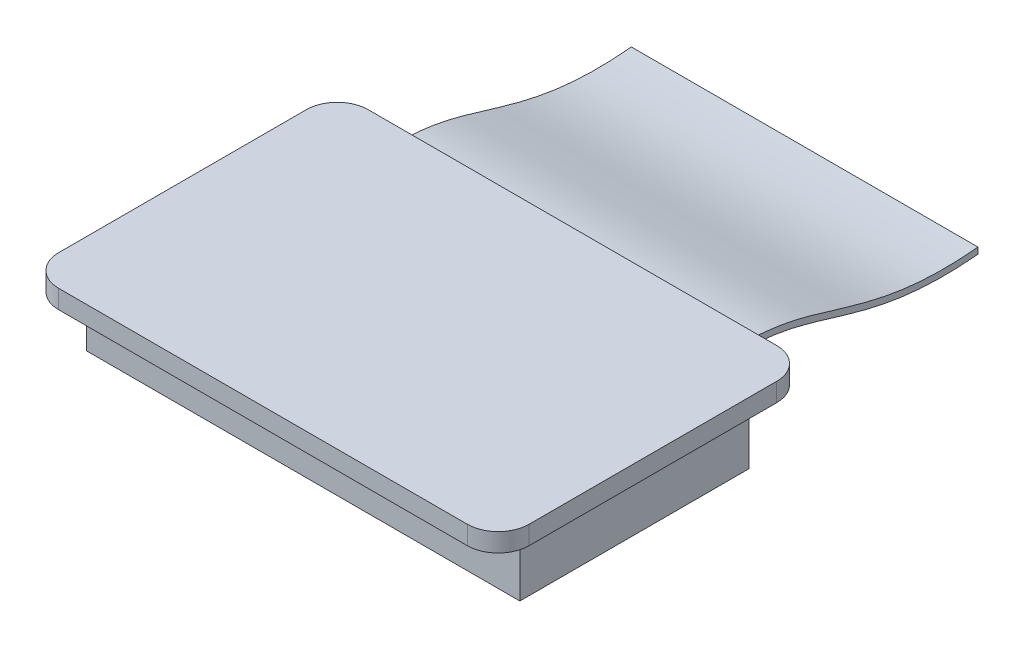
ISO-10303-21;
HEADER;
FILE_DESCRIPTION(('STEP AP214'),'2;1');
FILE_NAME('part.step','',(''),(''),'','','');
FILE_SCHEMA(('AUTOMOTIVE_DESIGN { 1 0 10303 214 1 1 1 1 }'));
ENDSEC;
DATA;
#1=APPLICATION_CONTEXT('core data for automotive mechanical design processes');
#2=APPLICATION_PROTOCOL_DEFINITION('international standard','automotive_design',2000,#1);
#3=PRODUCT_CONTEXT('',#1,'mechanical');
#4=PRODUCT('Part','Part','',(#3));
#5=PRODUCT_RELATED_PRODUCT_CATEGORY('part','',(#4));
#6=PRODUCT_DEFINITION_FORMATION('','',#4);
#7=PRODUCT_DEFINITION_CONTEXT('part definition',#1,'design');
#8=PRODUCT_DEFINITION('design','',#6,#7);
#9=PRODUCT_DEFINITION_SHAPE('','',#8);
#10=(LENGTH_UNIT() NAMED_UNIT(*) SI_UNIT(.MILLI.,.METRE.));
#11=(NAMED_UNIT(*) PLANE_ANGLE_UNIT() SI_UNIT($,.RADIAN.));
#12=(NAMED_UNIT(*) SI_UNIT($,.STERADIAN.) SOLID_ANGLE_UNIT());
#13=UNCERTAINTY_MEASURE_WITH_UNIT(LENGTH_MEASURE(1.E-05),#10,'distance_accuracy_value','');
#14=(GEOMETRIC_REPRESENTATION_CONTEXT(3) GLOBAL_UNCERTAINTY_ASSIGNED_CONTEXT((#13)) GLOBAL_UNIT_ASSIGNED_CONTEXT((#10,
#11,#12)) REPRESENTATION_CONTEXT('',''));
#15=CARTESIAN_POINT('',(0.,0.,0.));
#16=DIRECTION('',(0.,0.,1.));
#17=DIRECTION('',(1.,0.,0.));
#18=AXIS2_PLACEMENT_3D('',#15,#16,#17);
#19=CARTESIAN_POINT('',(3.3,0.748301222298696,8.25169585037883));
#20=DIRECTION('',(0.,-1.,0.));
#21=DIRECTION('',(0.,0.,-1.));
#22=AXIS2_PLACEMENT_3D('',#19,#20,#21);
#23=CYLINDRICAL_SURFACE('',#22,0.5);
#24=CARTESIAN_POINT('',(3.3,0.448301222298696,8.25169585037883));
#25=DIRECTION('',(0.,-1.,0.));
#26=DIRECTION('',(0.,0.,-1.));
#27=AXIS2_PLACEMENT_3D('',#24,#25,#26);
#28=CIRCLE('',#27,0.5);
#29=CARTESIAN_POINT('',(3.3,0.448301222298696,7.75169585037883));
#30=VERTEX_POINT('',#29);
#31=CARTESIAN_POINT('',(3.8,0.448301222298696,8.25169585037883));
#32=VERTEX_POINT('',#31);
#33=EDGE_CURVE('E172',#30,#32,#28,.T.);
#34=ORIENTED_EDGE('',*,*,#33,.F.);
#35=DIRECTION('',(0.,-1.,0.));
#36=VECTOR('',#35,1.);
#37=CARTESIAN_POINT('',(3.3,0.748301222298696,7.75169585037883));
#38=LINE('',#37,#36);
#39=CARTESIAN_POINT('',(3.3,0.748301222298696,7.75169585037883));
#40=VERTEX_POINT('',#39);
#41=EDGE_CURVE('E13',#40,#30,#38,.T.);
#42=ORIENTED_EDGE('',*,*,#41,.F.);
#43=CARTESIAN_POINT('',(3.3,0.748301222298696,8.25169585037883));
#44=DIRECTION('',(0.,-1.,0.));
#45=DIRECTION('',(0.,0.,-1.));
#46=AXIS2_PLACEMENT_3D('',#43,#44,#45);
#47=CIRCLE('',#46,0.5);
#48=CARTESIAN_POINT('',(3.8,0.748301222298696,8.25169585037883));
#49=VERTEX_POINT('',#48);
#50=EDGE_CURVE('E193',#40,#49,#47,.T.);
#51=ORIENTED_EDGE('',*,*,#50,.T.);
#52=DIRECTION('',(0.,-1.,0.));
#53=VECTOR('',#52,1.);
#54=CARTESIAN_POINT('',(3.8,0.748301222298696,8.25169585037883));
#55=LINE('',#54,#53);
#56=EDGE_CURVE('E65',#49,#32,#55,.T.);
#57=ORIENTED_EDGE('',*,*,#56,.T.);
#58=EDGE_LOOP('',(#34,#42,#51,#57));
#59=FACE_BOUND('',#58,.T.);
#60=ADVANCED_FACE('F62',(#59),#23,.T.);
#61=CARTESIAN_POINT('',(-3.3,0.748301222298696,7.75169585037883));
#62=DIRECTION('',(0.,0.,-1.));
#63=DIRECTION('',(-1.,0.,0.));
#64=AXIS2_PLACEMENT_3D('',#61,#62,#63);
#65=PLANE('',#64);
#66=DIRECTION('',(1.,0.,0.));
#67=VECTOR('',#66,1.);
#68=CARTESIAN_POINT('',(-3.3,0.448301222298696,7.75169585037883));
#69=LINE('',#68,#67);
#70=CARTESIAN_POINT('',(-3.3,0.448301222298696,7.75169585037883));
#71=VERTEX_POINT('',#70);
#72=EDGE_CURVE('E191',#71,#30,#69,.T.);
#73=ORIENTED_EDGE('',*,*,#72,.F.);
#74=DIRECTION('',(0.,-1.,0.));
#75=VECTOR('',#74,1.);
#76=CARTESIAN_POINT('',(-3.3,0.748301222298696,7.75169585037883));
#77=LINE('',#76,#75);
#78=CARTESIAN_POINT('',(-3.3,0.748301222298696,7.75169585037883));
#79=VERTEX_POINT('',#78);
#80=EDGE_CURVE('E70',#79,#71,#77,.T.);
#81=ORIENTED_EDGE('',*,*,#80,.F.);
#82=DIRECTION('',(1.,0.,0.));
#83=VECTOR('',#82,1.);
#84=CARTESIAN_POINT('',(-3.3,0.748301222298696,7.75169585037883));
#85=LINE('',#84,#83);
#86=EDGE_CURVE('E162',#79,#40,#85,.T.);
#87=ORIENTED_EDGE('',*,*,#86,.T.);
#88=ORIENTED_EDGE('',*,*,#41,.T.);
#89=EDGE_LOOP('',(#73,#81,#87,#88));
#90=FACE_BOUND('',#89,.T.);
#91=ADVANCED_FACE('F205',(#90),#65,.T.);
#92=CARTESIAN_POINT('',(-3.3,0.748301222298696,8.25169585037883));
#93=DIRECTION('',(0.,-1.,0.));
#94=DIRECTION('',(0.,0.,-1.));
#95=AXIS2_PLACEMENT_3D('',#92,#93,#94);
#96=CYLINDRICAL_SURFACE('',#95,0.5);
#97=CARTESIAN_POINT('',(-3.3,0.448301222298696,8.25169585037883));
#98=DIRECTION('',(0.,-1.,0.));
#99=DIRECTION('',(0.,0.,-1.));
#100=AXIS2_PLACEMENT_3D('',#97,#98,#99);
#101=CIRCLE('',#100,0.5);
#102=CARTESIAN_POINT('',(-3.8,0.448301222298696,8.25169585037883));
#103=VERTEX_POINT('',#102);
#104=EDGE_CURVE('E149',#103,#71,#101,.T.);
#105=ORIENTED_EDGE('',*,*,#104,.F.);
#106=DIRECTION('',(0.,-1.,0.));
#107=VECTOR('',#106,1.);
#108=CARTESIAN_POINT('',(-3.8,0.748301222298696,8.25169585037883));
#109=LINE('',#108,#107);
#110=CARTESIAN_POINT('',(-3.8,0.748301222298696,8.25169585037883));
#111=VERTEX_POINT('',#110);
#112=EDGE_CURVE('E143',#111,#103,#109,.T.);
#113=ORIENTED_EDGE('',*,*,#112,.F.);
#114=CARTESIAN_POINT('',(-3.3,0.748301222298696,8.25169585037883));
#115=DIRECTION('',(0.,-1.,0.));
#116=DIRECTION('',(0.,0.,-1.));
#117=AXIS2_PLACEMENT_3D('',#114,#115,#116);
#118=CIRCLE('',#117,0.5);
#119=EDGE_CURVE('E146',#111,#79,#118,.T.);
#120=ORIENTED_EDGE('',*,*,#119,.T.);
#121=ORIENTED_EDGE('',*,*,#80,.T.);
#122=EDGE_LOOP('',(#105,#113,#120,#121));
#123=FACE_BOUND('',#122,.T.);
#124=ADVANCED_FACE('F145',(#123),#96,.T.);
#125=CARTESIAN_POINT('',(-3.8,0.748301222298696,12.2516958503788));
#126=DIRECTION('',(-1.,0.,0.));
#127=DIRECTION('',(0.,0.,1.));
#128=AXIS2_PLACEMENT_3D('',#125,#126,#127);
#129=PLANE('',#128);
#130=DIRECTION('',(0.,0.,-1.));
#131=VECTOR('',#130,1.);
#132=CARTESIAN_POINT('',(-3.8,0.448301222298696,12.2516958503788));
#133=LINE('',#132,#131);
#134=CARTESIAN_POINT('',(-3.8,0.448301222298696,12.2516958503788));
#135=VERTEX_POINT('',#134);
#136=EDGE_CURVE('E188',#135,#103,#133,.T.);
#137=ORIENTED_EDGE('',*,*,#136,.F.);
#138=DIRECTION('',(0.,-1.,0.));
#139=VECTOR('',#138,1.);
#140=CARTESIAN_POINT('',(-3.8,0.748301222298696,12.2516958503788));
#141=LINE('',#140,#139);
#142=CARTESIAN_POINT('',(-3.8,0.748301222298696,12.2516958503788));
#143=VERTEX_POINT('',#142);
#144=EDGE_CURVE('E154',#143,#135,#141,.T.);
#145=ORIENTED_EDGE('',*,*,#144,.F.);
#146=DIRECTION('',(0.,0.,-1.));
#147=VECTOR('',#146,1.);
#148=CARTESIAN_POINT('',(-3.8,0.748301222298696,12.2516958503788));
#149=LINE('',#148,#147);
#150=EDGE_CURVE('E160',#143,#111,#149,.T.);
#151=ORIENTED_EDGE('',*,*,#150,.T.);
#152=ORIENTED_EDGE('',*,*,#112,.T.);
#153=EDGE_LOOP('',(#137,#145,#151,#152));
#154=FACE_BOUND('',#153,.T.);
#155=ADVANCED_FACE('F164',(#154),#129,.T.);
#156=CARTESIAN_POINT('',(-3.3,0.748301222298696,12.2516958503788));
#157=DIRECTION('',(0.,-1.,0.));
#158=DIRECTION('',(0.,0.,-1.));
#159=AXIS2_PLACEMENT_3D('',#156,#157,#158);
#160=CYLINDRICAL_SURFACE('',#159,0.5);
#161=CARTESIAN_POINT('',(-3.3,0.448301222298696,12.2516958503788));
#162=DIRECTION('',(0.,-1.,0.));
#163=DIRECTION('',(0.,0.,-1.));
#164=AXIS2_PLACEMENT_3D('',#161,#162,#163);
#165=CIRCLE('',#164,0.5);
#166=CARTESIAN_POINT('',(-3.3,0.448301222298696,12.7516958503788));
#167=VERTEX_POINT('',#166);
#168=EDGE_CURVE('E185',#167,#135,#165,.T.);
#169=ORIENTED_EDGE('',*,*,#168,.F.);
#170=DIRECTION('',(0.,-1.,0.));
#171=VECTOR('',#170,1.);
#172=CARTESIAN_POINT('',(-3.3,0.748301222298696,12.7516958503788));
#173=LINE('',#172,#171);
#174=CARTESIAN_POINT('',(-3.3,0.748301222298696,12.7516958503788));
#175=VERTEX_POINT('',#174);
#176=EDGE_CURVE('E197',#175,#167,#173,.T.);
#177=ORIENTED_EDGE('',*,*,#176,.F.);
#178=CARTESIAN_POINT('',(-3.3,0.748301222298696,12.2516958503788));
#179=DIRECTION('',(0.,-1.,0.));
#180=DIRECTION('',(0.,0.,-1.));
#181=AXIS2_PLACEMENT_3D('',#178,#179,#180);
#182=CIRCLE('',#181,0.5);
#183=EDGE_CURVE('E165',#175,#143,#182,.T.);
#184=ORIENTED_EDGE('',*,*,#183,.T.);
#185=ORIENTED_EDGE('',*,*,#144,.T.);
#186=EDGE_LOOP('',(#169,#177,#184,#185));
#187=FACE_BOUND('',#186,.T.);
#188=ADVANCED_FACE('F218',(#187),#160,.T.);
#189=CARTESIAN_POINT('',(-3.3,0.748301222298696,12.7516958503788));
#190=DIRECTION('',(0.,0.,1.));
#191=DIRECTION('',(1.,0.,0.));
#192=AXIS2_PLACEMENT_3D('',#189,#190,#191);
#193=PLANE('',#192);
#194=DIRECTION('',(-1.,0.,0.));
#195=VECTOR('',#194,1.);
#196=CARTESIAN_POINT('',(-3.3,0.448301222298696,12.7516958503788));
#197=LINE('',#196,#195);
#198=CARTESIAN_POINT('',(3.3,0.448301222298696,12.7516958503788));
#199=VERTEX_POINT('',#198);
#200=EDGE_CURVE('E182',#199,#167,#197,.T.);
#201=ORIENTED_EDGE('',*,*,#200,.F.);
#202=DIRECTION('',(0.,-1.,0.));
#203=VECTOR('',#202,1.);
#204=CARTESIAN_POINT('',(3.3,0.748301222298696,12.7516958503788));
#205=LINE('',#204,#203);
#206=CARTESIAN_POINT('',(3.3,0.748301222298696,12.7516958503788));
#207=VERTEX_POINT('',#206);
#208=EDGE_CURVE('E199',#207,#199,#205,.T.);
#209=ORIENTED_EDGE('',*,*,#208,.F.);
#210=DIRECTION('',(-1.,0.,0.));
#211=VECTOR('',#210,1.);
#212=CARTESIAN_POINT('',(-3.3,0.748301222298696,12.7516958503788));
#213=LINE('',#212,#211);
#214=EDGE_CURVE('E167',#207,#175,#213,.T.);
#215=ORIENTED_EDGE('',*,*,#214,.T.);
#216=ORIENTED_EDGE('',*,*,#176,.T.);
#217=EDGE_LOOP('',(#201,#209,#215,#216));
#218=FACE_BOUND('',#217,.T.);
#219=ADVANCED_FACE('F221',(#218),#193,.T.);
#220=CARTESIAN_POINT('',(3.3,0.748301222298696,12.2516958503788));
#221=DIRECTION('',(0.,-1.,0.));
#222=DIRECTION('',(0.,0.,-1.));
#223=AXIS2_PLACEMENT_3D('',#220,#221,#222);
#224=CYLINDRICAL_SURFACE('',#223,0.5);
#225=CARTESIAN_POINT('',(3.3,0.448301222298696,12.2516958503788));
#226=DIRECTION('',(0.,-1.,0.));
#227=DIRECTION('',(0.,0.,1.));
#228=AXIS2_PLACEMENT_3D('',#225,#226,#227);
#229=CIRCLE('',#228,0.5);
#230=CARTESIAN_POINT('',(3.8,0.448301222298696,12.2516958503788));
#231=VERTEX_POINT('',#230);
#232=EDGE_CURVE('E179',#231,#199,#229,.T.);
#233=ORIENTED_EDGE('',*,*,#232,.F.);
#234=DIRECTION('',(0.,-1.,0.));
#235=VECTOR('',#234,1.);
#236=CARTESIAN_POINT('',(3.8,0.748301222298696,12.2516958503788));
#237=LINE('',#236,#235);
#238=CARTESIAN_POINT('',(3.8,0.748301222298696,12.2516958503788));
#239=VERTEX_POINT('',#238);
#240=EDGE_CURVE('E200',#239,#231,#237,.T.);
#241=ORIENTED_EDGE('',*,*,#240,.F.);
#242=CARTESIAN_POINT('',(3.3,0.748301222298696,12.2516958503788));
#243=DIRECTION('',(0.,-1.,0.));
#244=DIRECTION('',(0.,0.,1.));
#245=AXIS2_PLACEMENT_3D('',#242,#243,#244);
#246=CIRCLE('',#245,0.5);
#247=EDGE_CURVE('E289',#239,#207,#246,.T.);
#248=ORIENTED_EDGE('',*,*,#247,.T.);
#249=ORIENTED_EDGE('',*,*,#208,.T.);
#250=EDGE_LOOP('',(#233,#241,#248,#249));
#251=FACE_BOUND('',#250,.T.);
#252=ADVANCED_FACE('F225',(#251),#224,.T.);
#253=CARTESIAN_POINT('',(3.8,0.748301222298696,12.2516958503788));
#254=DIRECTION('',(1.,0.,0.));
#255=DIRECTION('',(0.,0.,-1.));
#256=AXIS2_PLACEMENT_3D('',#253,#254,#255);
#257=PLANE('',#256);
#258=DIRECTION('',(0.,0.,1.));
#259=VECTOR('',#258,1.);
#260=CARTESIAN_POINT('',(3.8,0.448301222298696,12.2516958503788));
#261=LINE('',#260,#259);
#262=EDGE_CURVE('E175',#32,#231,#261,.T.);
#263=ORIENTED_EDGE('',*,*,#262,.F.);
#264=ORIENTED_EDGE('',*,*,#56,.F.);
#265=DIRECTION('',(0.,0.,1.));
#266=VECTOR('',#265,1.);
#267=CARTESIAN_POINT('',(3.8,0.748301222298696,12.2516958503788));
#268=LINE('',#267,#266);
#269=EDGE_CURVE('E287',#49,#239,#268,.T.);
#270=ORIENTED_EDGE('',*,*,#269,.T.);
#271=ORIENTED_EDGE('',*,*,#240,.T.);
#272=EDGE_LOOP('',(#263,#264,#270,#271));
#273=FACE_BOUND('',#272,.T.);
#274=ADVANCED_FACE('F202',(#273),#257,.T.);
#275=CARTESIAN_POINT('',(3.3,0.748301222298696,8.25169585037883));
#276=DIRECTION('',(0.,-1.,0.));
#277=DIRECTION('',(0.,0.,-1.));
#278=AXIS2_PLACEMENT_3D('',#275,#276,#277);
#279=PLANE('',#278);
#280=ORIENTED_EDGE('',*,*,#50,.F.);
#281=ORIENTED_EDGE('',*,*,#86,.F.);
#282=ORIENTED_EDGE('',*,*,#119,.F.);
#283=ORIENTED_EDGE('',*,*,#150,.F.);
#284=ORIENTED_EDGE('',*,*,#183,.F.);
#285=ORIENTED_EDGE('',*,*,#214,.F.);
#286=ORIENTED_EDGE('',*,*,#247,.F.);
#287=ORIENTED_EDGE('',*,*,#269,.F.);
#288=EDGE_LOOP('',(#280,#281,#282,#283,#284,#285,#286,#287));
#289=FACE_BOUND('',#288,.T.);
#290=ADVANCED_FACE('F158',(#289),#279,.F.);
#291=CARTESIAN_POINT('',(3.3,0.448301222298696,8.25169585037883));
#292=DIRECTION('',(0.,-1.,0.));
#293=DIRECTION('',(0.,0.,-1.));
#294=AXIS2_PLACEMENT_3D('',#291,#292,#293);
#295=PLANE('',#294);
#296=DIRECTION('',(0.,0.,1.));
#297=VECTOR('',#296,1.);
#298=CARTESIAN_POINT('',(3.5,0.448301222298696,12.1016958503788));
#299=LINE('',#298,#297);
#300=CARTESIAN_POINT('',(3.5,0.448301222298696,8.40169585037883));
#301=VERTEX_POINT('',#300);
#302=CARTESIAN_POINT('',(3.5,0.448301222298696,12.1016958503788));
#303=VERTEX_POINT('',#302);
#304=EDGE_CURVE('E271',#301,#303,#299,.T.);
#305=ORIENTED_EDGE('',*,*,#304,.F.);
#306=DIRECTION('',(-1.,0.,0.));
#307=VECTOR('',#306,1.);
#308=CARTESIAN_POINT('',(3.5,0.448301222298696,8.40169585037883));
#309=LINE('',#308,#307);
#310=CARTESIAN_POINT('',(-3.5,0.448301222298696,8.40169585037883));
#311=VERTEX_POINT('',#310);
#312=EDGE_CURVE('E282',#301,#311,#309,.T.);
#313=ORIENTED_EDGE('',*,*,#312,.T.);
#314=DIRECTION('',(0.,0.,1.));
#315=VECTOR('',#314,1.);
#316=CARTESIAN_POINT('',(-3.5,0.448301222298696,12.1016958503788));
#317=LINE('',#316,#315);
#318=CARTESIAN_POINT('',(-3.5,0.448301222298696,12.1016958503788));
#319=VERTEX_POINT('',#318);
#320=EDGE_CURVE('E274',#311,#319,#317,.T.);
#321=ORIENTED_EDGE('',*,*,#320,.T.);
#322=DIRECTION('',(-1.,0.,0.));
#323=VECTOR('',#322,1.);
#324=CARTESIAN_POINT('',(3.5,0.448301222298696,12.1016958503788));
#325=LINE('',#324,#323);
#326=EDGE_CURVE('E298',#303,#319,#325,.T.);
#327=ORIENTED_EDGE('',*,*,#326,.F.);
#328=EDGE_LOOP('',(#305,#313,#321,#327));
#329=FACE_BOUND('',#328,.T.);
#330=ORIENTED_EDGE('',*,*,#33,.T.);
#331=ORIENTED_EDGE('',*,*,#262,.T.);
#332=ORIENTED_EDGE('',*,*,#232,.T.);
#333=ORIENTED_EDGE('',*,*,#200,.T.);
#334=ORIENTED_EDGE('',*,*,#168,.T.);
#335=ORIENTED_EDGE('',*,*,#136,.T.);
#336=ORIENTED_EDGE('',*,*,#104,.T.);
#337=ORIENTED_EDGE('',*,*,#72,.T.);
#338=EDGE_LOOP('',(#330,#331,#332,#333,#334,#335,#336,#337));
#339=FACE_BOUND('',#338,.T.);
#340=ADVANCED_FACE('F204',(#329,#339),#295,.T.);
#341=CARTESIAN_POINT('',(3.5,0.448301222298696,12.1016958503788));
#342=DIRECTION('',(0.,0.,-1.));
#343=DIRECTION('',(-1.,0.,0.));
#344=AXIS2_PLACEMENT_3D('',#341,#342,#343);
#345=PLANE('',#344);
#346=DIRECTION('',(0.,-1.,0.));
#347=VECTOR('',#346,1.);
#348=CARTESIAN_POINT('',(-3.5,0.448301222298696,12.1016958503788));
#349=LINE('',#348,#347);
#350=CARTESIAN_POINT('',(-3.5,-0.551698777701304,12.1016958503788));
#351=VERTEX_POINT('',#350);
#352=EDGE_CURVE('E78',#319,#351,#349,.T.);
#353=ORIENTED_EDGE('',*,*,#352,.T.);
#354=DIRECTION('',(-1.,0.,0.));
#355=VECTOR('',#354,1.);
#356=CARTESIAN_POINT('',(3.5,-0.551698777701304,12.1016958503788));
#357=LINE('',#356,#355);
#358=CARTESIAN_POINT('',(3.5,-0.551698777701304,12.1016958503788));
#359=VERTEX_POINT('',#358);
#360=EDGE_CURVE('E176',#359,#351,#357,.T.);
#361=ORIENTED_EDGE('',*,*,#360,.F.);
#362=DIRECTION('',(0.,-1.,0.));
#363=VECTOR('',#362,1.);
#364=CARTESIAN_POINT('',(3.5,0.448301222298696,12.1016958503788));
#365=LINE('',#364,#363);
#366=EDGE_CURVE('E263',#303,#359,#365,.T.);
#367=ORIENTED_EDGE('',*,*,#366,.F.);
#368=ORIENTED_EDGE('',*,*,#326,.T.);
#369=EDGE_LOOP('',(#353,#361,#367,#368));
#370=FACE_BOUND('',#369,.T.);
#371=ADVANCED_FACE('F236',(#370),#345,.F.);
#372=CARTESIAN_POINT('',(3.5,-0.551698777701304,12.1016958503788));
#373=DIRECTION('',(0.,1.,0.));
#374=DIRECTION('',(0.,0.,1.));
#375=AXIS2_PLACEMENT_3D('',#372,#373,#374);
#376=PLANE('',#375);
#377=DIRECTION('',(0.,0.,-1.));
#378=VECTOR('',#377,1.);
#379=CARTESIAN_POINT('',(-3.5,-0.551698777701304,12.1016958503788));
#380=LINE('',#379,#378);
#381=CARTESIAN_POINT('',(-3.5,-0.551698777701304,8.40169585037883));
#382=VERTEX_POINT('',#381);
#383=EDGE_CURVE('E305',#351,#382,#380,.T.);
#384=ORIENTED_EDGE('',*,*,#383,.T.);
#385=DIRECTION('',(-1.,0.,0.));
#386=VECTOR('',#385,1.);
#387=CARTESIAN_POINT('',(3.5,-0.551698777701304,8.40169585037883));
#388=LINE('',#387,#386);
#389=CARTESIAN_POINT('',(3.5,-0.551698777701304,8.40169585037883));
#390=VERTEX_POINT('',#389);
#391=EDGE_CURVE('E279',#390,#382,#388,.T.);
#392=ORIENTED_EDGE('',*,*,#391,.F.);
#393=DIRECTION('',(0.,0.,-1.));
#394=VECTOR('',#393,1.);
#395=CARTESIAN_POINT('',(3.5,-0.551698777701304,12.1016958503788));
#396=LINE('',#395,#394);
#397=EDGE_CURVE('E268',#359,#390,#396,.T.);
#398=ORIENTED_EDGE('',*,*,#397,.F.);
#399=ORIENTED_EDGE('',*,*,#360,.T.);
#400=EDGE_LOOP('',(#384,#392,#398,#399));
#401=FACE_BOUND('',#400,.T.);
#402=ADVANCED_FACE('F241',(#401),#376,.F.);
#403=CARTESIAN_POINT('',(3.5,0.448301222298696,8.40169585037883));
#404=DIRECTION('',(0.,0.,1.));
#405=DIRECTION('',(1.,0.,0.));
#406=AXIS2_PLACEMENT_3D('',#403,#404,#405);
#407=PLANE('',#406);
#408=DIRECTION('',(0.,1.,0.));
#409=VECTOR('',#408,1.);
#410=CARTESIAN_POINT('',(-3.5,0.448301222298696,8.40169585037883));
#411=LINE('',#410,#409);
#412=EDGE_CURVE('E302',#382,#311,#411,.T.);
#413=ORIENTED_EDGE('',*,*,#412,.T.);
#414=ORIENTED_EDGE('',*,*,#312,.F.);
#415=DIRECTION('',(0.,1.,0.));
#416=VECTOR('',#415,1.);
#417=CARTESIAN_POINT('',(3.5,0.448301222298696,8.40169585037883));
#418=LINE('',#417,#416);
#419=EDGE_CURVE('E309',#390,#301,#418,.T.);
#420=ORIENTED_EDGE('',*,*,#419,.F.);
#421=ORIENTED_EDGE('',*,*,#391,.T.);
#422=EDGE_LOOP('',(#413,#414,#420,#421));
#423=FACE_BOUND('',#422,.T.);
#424=ADVANCED_FACE('F245',(#423),#407,.F.);
#425=CARTESIAN_POINT('',(3.5,0.,0.));
#426=DIRECTION('',(1.,0.,0.));
#427=DIRECTION('',(0.,0.,-1.));
#428=AXIS2_PLACEMENT_3D('',#425,#426,#427);
#429=PLANE('',#428);
#430=ORIENTED_EDGE('',*,*,#366,.T.);
#431=ORIENTED_EDGE('',*,*,#397,.T.);
#432=ORIENTED_EDGE('',*,*,#419,.T.);
#433=ORIENTED_EDGE('',*,*,#304,.T.);
#434=EDGE_LOOP('',(#430,#431,#432,#433));
#435=FACE_BOUND('',#434,.T.);
#436=ADVANCED_FACE('F249',(#435),#429,.T.);
#437=CARTESIAN_POINT('',(-3.5,0.,0.));
#438=DIRECTION('',(1.,0.,0.));
#439=DIRECTION('',(0.,0.,-1.));
#440=AXIS2_PLACEMENT_3D('',#437,#438,#439);
#441=PLANE('',#440);
#442=ORIENTED_EDGE('',*,*,#352,.F.);
#443=ORIENTED_EDGE('',*,*,#320,.F.);
#444=ORIENTED_EDGE('',*,*,#412,.F.);
#445=ORIENTED_EDGE('',*,*,#383,.F.);
#446=EDGE_LOOP('',(#442,#443,#444,#445));
#447=FACE_BOUND('',#446,.T.);
#448=ADVANCED_FACE('F251',(#447),#441,.F.);
#449=CLOSED_SHELL('',(#60,#91,#124,#155,#188,#219,#252,#274,#290,#340,#371,#402,#424,#436,#448));
#450=MANIFOLD_SOLID_BREP('B2',#449);
#451=CARTESIAN_POINT('',(0.,0.547843022465263,7.7421339457778));
#452=DIRECTION('',(0.,0.0956190460103406,0.995418001665669));
#453=DIRECTION('',(1.,0.,0.));
#454=AXIS2_PLACEMENT_3D('',#451,#452,#453);
#455=PLANE('',#454);
#456=DIRECTION('',(0.,-0.995418001665668,0.0956190460103406));
#457=VECTOR('',#456,1.);
#458=CARTESIAN_POINT('',(-2.8,0.547843022465263,7.7421339457778));
#459=LINE('',#458,#457);
#460=CARTESIAN_POINT('',(-2.8,0.547843022465263,7.7421339457778));
#461=VERTEX_POINT('',#460);
#462=CARTESIAN_POINT('',(-2.8,0.448301222298696,7.75169585037883));
#463=VERTEX_POINT('',#462);
#464=EDGE_CURVE('E447',#461,#463,#459,.T.);
#465=ORIENTED_EDGE('',*,*,#464,.T.);
#466=DIRECTION('',(1.,0.,0.));
#467=VECTOR('',#466,1.);
#468=CARTESIAN_POINT('',(-2.8,0.448301222298696,7.75169585037883));
#469=LINE('',#468,#467);
#470=CARTESIAN_POINT('',(2.8,0.448301222298696,7.75169585037883));
#471=VERTEX_POINT('',#470);
#472=EDGE_CURVE('E453',#463,#471,#469,.T.);
#473=ORIENTED_EDGE('',*,*,#472,.T.);
#474=DIRECTION('',(0.,0.995418001665668,-0.0956190460103407));
#475=VECTOR('',#474,1.);
#476=CARTESIAN_POINT('',(2.8,0.547843022465264,7.7421339457778));
#477=LINE('',#476,#475);
#478=CARTESIAN_POINT('',(2.8,0.547843022465264,7.7421339457778));
#479=VERTEX_POINT('',#478);
#480=EDGE_CURVE('E448',#471,#479,#477,.T.);
#481=ORIENTED_EDGE('',*,*,#480,.T.);
#482=DIRECTION('',(-1.,0.,0.));
#483=VECTOR('',#482,1.);
#484=CARTESIAN_POINT('',(-2.8,0.547843022465263,7.7421339457778));
#485=LINE('',#484,#483);
#486=EDGE_CURVE('E408',#479,#461,#485,.T.);
#487=ORIENTED_EDGE('',*,*,#486,.T.);
#488=EDGE_LOOP('',(#465,#473,#481,#487));
#489=FACE_BOUND('',#488,.T.);
#490=ADVANCED_FACE('F404',(#489),#455,.T.);
#491=CARTESIAN_POINT('',(0.,0.,3.99999999999998));
#492=DIRECTION('',(0.,0.,1.));
#493=DIRECTION('',(1.,0.,0.));
#494=AXIS2_PLACEMENT_3D('',#491,#492,#493);
#495=PLANE('',#494);
#496=DIRECTION('',(0.,-1.,0.));
#497=VECTOR('',#496,1.);
#498=CARTESIAN_POINT('',(-2.8,0.,3.99999999999998));
#499=LINE('',#498,#497);
#500=CARTESIAN_POINT('',(-2.8,0.,3.99999999999998));
#501=VERTEX_POINT('',#500);
#502=CARTESIAN_POINT('',(-2.8,-0.0999999999999998,3.99999999999998));
#503=VERTEX_POINT('',#502);
#504=EDGE_CURVE('E457',#501,#503,#499,.T.);
#505=ORIENTED_EDGE('',*,*,#504,.F.);
#506=DIRECTION('',(-1.,0.,0.));
#507=VECTOR('',#506,1.);
#508=CARTESIAN_POINT('',(-2.8,0.,3.99999999999998));
#509=LINE('',#508,#507);
#510=CARTESIAN_POINT('',(2.8,0.,3.99999999999998));
#511=VERTEX_POINT('',#510);
#512=EDGE_CURVE('E60',#511,#501,#509,.T.);
#513=ORIENTED_EDGE('',*,*,#512,.F.);
#514=DIRECTION('',(0.,1.,0.));
#515=VECTOR('',#514,1.);
#516=CARTESIAN_POINT('',(2.8,0.,3.99999999999998));
#517=LINE('',#516,#515);
#518=CARTESIAN_POINT('',(2.8,-0.0999999999999998,3.99999999999998));
#519=VERTEX_POINT('',#518);
#520=EDGE_CURVE('E414',#519,#511,#517,.T.);
#521=ORIENTED_EDGE('',*,*,#520,.F.);
#522=DIRECTION('',(1.,0.,0.));
#523=VECTOR('',#522,1.);
#524=CARTESIAN_POINT('',(-2.8,-0.0999999999999998,3.99999999999998));
#525=LINE('',#524,#523);
#526=EDGE_CURVE('E459',#503,#519,#525,.T.);
#527=ORIENTED_EDGE('',*,*,#526,.F.);
#528=EDGE_LOOP('',(#505,#513,#521,#527));
#529=FACE_BOUND('',#528,.T.);
#530=ADVANCED_FACE('F497',(#529),#495,.F.);
#531=CARTESIAN_POINT('',(2.8,0.,3.99999999999998));
#532=CARTESIAN_POINT('',(2.8,-0.024628468128532,4.25638846601688));
#533=CARTESIAN_POINT('',(2.8,-0.0386180157529813,4.72259081002346));
#534=CARTESIAN_POINT('',(2.8,0.0194715301087125,5.3120111853385));
#535=CARTESIAN_POINT('',(2.8,0.129906644668738,5.82138904334296));
#536=CARTESIAN_POINT('',(2.8,0.291873769263778,6.3680270958267));
#537=CARTESIAN_POINT('',(2.8,0.477782991355757,6.96597559310497));
#538=CARTESIAN_POINT('',(2.8,0.547843022465264,7.46326880544397));
#539=CARTESIAN_POINT('',(2.8,0.547843022465264,7.74213394577779));
#540=CARTESIAN_POINT('',(-2.8,0.,3.99999999999998));
#541=CARTESIAN_POINT('',(-2.8,-0.0246284681285331,4.25638846601688));
#542=CARTESIAN_POINT('',(-2.8,-0.0386180157529824,4.72259081002346));
#543=CARTESIAN_POINT('',(-2.8,0.0194715301087115,5.3120111853385));
#544=CARTESIAN_POINT('',(-2.8,0.129906644668737,5.82138904334296));
#545=CARTESIAN_POINT('',(-2.8,0.291873769263777,6.3680270958267));
#546=CARTESIAN_POINT('',(-2.8,0.477782991355756,6.96597559310497));
#547=CARTESIAN_POINT('',(-2.8,0.547843022465263,7.46326880544397));
#548=CARTESIAN_POINT('',(-2.8,0.547843022465263,7.74213394577779));
#549=B_SPLINE_SURFACE_WITH_KNOTS('',1,3,((#531,#532,#533,#534,#535,#536,#537,#538,#539),(#540,
#541,#542,#543,#544,#545,#546,#547,#548)),.UNSPECIFIED.,.F.,.F.,.F.,(2,2),(4,1,1,1,1,1,4),
(0.508771929824561,1.),(0.,0.14,0.28,0.42,0.559999999997895,0.780000000000162,1.),.UNSPECIFIED.);
#550=CARTESIAN_POINT('',(-2.8,0.,3.99999999999998));
#551=CARTESIAN_POINT('',(-2.8,-0.0246284681285331,4.25638846601688));
#552=CARTESIAN_POINT('',(-2.8,-0.0386180157529824,4.72259081002346));
#553=CARTESIAN_POINT('',(-2.8,0.0194715301087115,5.3120111853385));
#554=CARTESIAN_POINT('',(-2.8,0.129906644668737,5.82138904334296));
#555=CARTESIAN_POINT('',(-2.8,0.291873769263777,6.3680270958267));
#556=CARTESIAN_POINT('',(-2.8,0.477782991355756,6.96597559310497));
#557=CARTESIAN_POINT('',(-2.8,0.547843022465263,7.46326880544397));
#558=CARTESIAN_POINT('',(-2.8,0.547843022465263,7.74213394577779));
#559=B_SPLINE_CURVE_WITH_KNOTS('',3,(#550,#551,#552,#553,#554,#555,#556,#557,#558),
.UNSPECIFIED.,.F.,.F.,(4,1,1,1,1,1,4),(0.,0.14,0.28,0.42,0.559999999997895,0.780000000000162,
1.),.UNSPECIFIED.);
#560=EDGE_CURVE('E423',#501,#461,#559,.T.);
#561=CARTESIAN_POINT('',(2.8,0.,3.99999999999998));
#562=CARTESIAN_POINT('',(2.8,-0.024628468128532,4.25638846601688));
#563=CARTESIAN_POINT('',(2.8,-0.0386180157529813,4.72259081002346));
#564=CARTESIAN_POINT('',(2.8,0.0194715301087125,5.3120111853385));
#565=CARTESIAN_POINT('',(2.8,0.129906644668738,5.82138904334296));
#566=CARTESIAN_POINT('',(2.8,0.291873769263778,6.3680270958267));
#567=CARTESIAN_POINT('',(2.8,0.477782991355757,6.96597559310497));
#568=CARTESIAN_POINT('',(2.8,0.547843022465264,7.46326880544397));
#569=CARTESIAN_POINT('',(2.8,0.547843022465264,7.74213394577779));
#570=B_SPLINE_CURVE_WITH_KNOTS('',3,(#561,#562,#563,#564,#565,#566,#567,#568,#569),
.UNSPECIFIED.,.F.,.F.,(4,1,1,1,1,1,4),(0.,0.14,0.28,0.42,0.559999999997895,0.780000000000162,
1.),.UNSPECIFIED.);
#571=EDGE_CURVE('E440',#511,#479,#570,.T.);
#572=ORIENTED_EDGE('',*,*,#512,.T.);
#573=ORIENTED_EDGE('',*,*,#560,.T.);
#574=ORIENTED_EDGE('',*,*,#486,.F.);
#575=ORIENTED_EDGE('',*,*,#571,.F.);
#576=EDGE_LOOP('',(#572,#573,#574,#575));
#577=FACE_BOUND('',#576,.T.);
#578=ADVANCED_FACE('F455',(#577),#549,.T.);
#579=CARTESIAN_POINT('',(2.8,-0.0999999999999998,3.99999999999998));
#580=DIRECTION('',(1.,0.,0.));
#581=DIRECTION('',(0.,1.,0.));
#582=AXIS2_PLACEMENT_3D('',#579,#580,#581);
#583=PLANE('',#582);
#584=ORIENTED_EDGE('',*,*,#520,.T.);
#585=ORIENTED_EDGE('',*,*,#571,.T.);
#586=ORIENTED_EDGE('',*,*,#480,.F.);
#587=CARTESIAN_POINT('',(2.8,-0.0999999999999998,3.99999999999998));
#588=CARTESIAN_POINT('',(2.8,-0.124487822602086,4.2605128606233));
#589=CARTESIAN_POINT('',(2.8,-0.13819607917364,4.73496399384273));
#590=CARTESIAN_POINT('',(2.8,-0.0775684463145836,5.33705516657012));
#591=CARTESIAN_POINT('',(2.8,0.0359942616894102,5.85609097163903));
#592=CARTESIAN_POINT('',(2.8,0.200282397231649,6.40790162664091));
#593=CARTESIAN_POINT('',(2.8,0.38279321622902,6.99976726735009));
#594=CARTESIAN_POINT('',(2.8,0.449818563978634,7.48090729992634));
#595=CARTESIAN_POINT('',(2.8,0.448301222298696,7.75169585037883));
#596=B_SPLINE_CURVE_WITH_KNOTS('',3,(#587,#588,#589,#590,#591,#592,#593,#594,#595),
.UNSPECIFIED.,.F.,.F.,(4,1,1,1,1,1,4),(0.,0.14,0.28,0.42,0.559999999997895,0.780000000000162,
1.),.UNSPECIFIED.);
#597=EDGE_CURVE('E461',#519,#471,#596,.T.);
#598=ORIENTED_EDGE('',*,*,#597,.F.);
#599=EDGE_LOOP('',(#584,#585,#586,#598));
#600=FACE_BOUND('',#599,.T.);
#601=ADVANCED_FACE('F493',(#600),#583,.T.);
#602=CARTESIAN_POINT('',(-2.8,-0.0999999999999998,3.99999999999998));
#603=CARTESIAN_POINT('',(-2.8,-0.124487822602086,4.2605128606233));
#604=CARTESIAN_POINT('',(-2.8,-0.13819607917364,4.73496399384273));
#605=CARTESIAN_POINT('',(-2.8,-0.0775684463145836,5.33705516657012));
#606=CARTESIAN_POINT('',(-2.8,0.0359942616894102,5.85609097163903));
#607=CARTESIAN_POINT('',(-2.8,0.200282397231649,6.40790162664091));
#608=CARTESIAN_POINT('',(-2.8,0.38279321622902,6.99976726735009));
#609=CARTESIAN_POINT('',(-2.8,0.449818563978634,7.48090729992634));
#610=CARTESIAN_POINT('',(-2.8,0.448301222298696,7.75169585037883));
#611=CARTESIAN_POINT('',(2.8,-0.0999999999999998,3.99999999999998));
#612=CARTESIAN_POINT('',(2.8,-0.124487822602086,4.2605128606233));
#613=CARTESIAN_POINT('',(2.8,-0.13819607917364,4.73496399384273));
#614=CARTESIAN_POINT('',(2.8,-0.0775684463145836,5.33705516657012));
#615=CARTESIAN_POINT('',(2.8,0.0359942616894102,5.85609097163903));
#616=CARTESIAN_POINT('',(2.8,0.200282397231649,6.40790162664091));
#617=CARTESIAN_POINT('',(2.8,0.38279321622902,6.99976726735009));
#618=CARTESIAN_POINT('',(2.8,0.449818563978634,7.48090729992634));
#619=CARTESIAN_POINT('',(2.8,0.448301222298696,7.75169585037883));
#620=B_SPLINE_SURFACE_WITH_KNOTS('',1,3,((#602,#603,#604,#605,#606,#607,#608,#609,#610),(#611,
#612,#613,#614,#615,#616,#617,#618,#619)),.UNSPECIFIED.,.F.,.F.,.F.,(2,2),(4,1,1,1,1,1,4),
(0.00877192982456138,0.5),(0.,0.14,0.28,0.42,0.559999999997895,0.780000000000162,1.),.UNSPECIFIED.);
#621=CARTESIAN_POINT('',(-2.8,-0.0999999999999998,3.99999999999998));
#622=CARTESIAN_POINT('',(-2.8,-0.124487822602086,4.2605128606233));
#623=CARTESIAN_POINT('',(-2.8,-0.13819607917364,4.73496399384273));
#624=CARTESIAN_POINT('',(-2.8,-0.0775684463145836,5.33705516657012));
#625=CARTESIAN_POINT('',(-2.8,0.0359942616894102,5.85609097163903));
#626=CARTESIAN_POINT('',(-2.8,0.200282397231649,6.40790162664091));
#627=CARTESIAN_POINT('',(-2.8,0.38279321622902,6.99976726735009));
#628=CARTESIAN_POINT('',(-2.8,0.449818563978634,7.48090729992634));
#629=CARTESIAN_POINT('',(-2.8,0.448301222298696,7.75169585037883));
#630=B_SPLINE_CURVE_WITH_KNOTS('',3,(#621,#622,#623,#624,#625,#626,#627,#628,#629),
.UNSPECIFIED.,.F.,.F.,(4,1,1,1,1,1,4),(0.,0.14,0.28,0.42,0.559999999997895,0.780000000000162,
1.),.UNSPECIFIED.);
#631=EDGE_CURVE('E450',#503,#463,#630,.T.);
#632=ORIENTED_EDGE('',*,*,#526,.T.);
#633=ORIENTED_EDGE('',*,*,#597,.T.);
#634=ORIENTED_EDGE('',*,*,#472,.F.);
#635=ORIENTED_EDGE('',*,*,#631,.F.);
#636=EDGE_LOOP('',(#632,#633,#634,#635));
#637=FACE_BOUND('',#636,.T.);
#638=ADVANCED_FACE('F490',(#637),#620,.T.);
#639=CARTESIAN_POINT('',(-2.8,0.,3.99999999999998));
#640=DIRECTION('',(-1.,0.,0.));
#641=DIRECTION('',(0.,-1.,0.));
#642=AXIS2_PLACEMENT_3D('',#639,#640,#641);
#643=PLANE('',#642);
#644=ORIENTED_EDGE('',*,*,#504,.T.);
#645=ORIENTED_EDGE('',*,*,#631,.T.);
#646=ORIENTED_EDGE('',*,*,#464,.F.);
#647=ORIENTED_EDGE('',*,*,#560,.F.);
#648=EDGE_LOOP('',(#644,#645,#646,#647));
#649=FACE_BOUND('',#648,.T.);
#650=ADVANCED_FACE('F406',(#649),#643,.T.);
#651=CLOSED_SHELL('',(#490,#530,#578,#601,#638,#650));
#652=MANIFOLD_SOLID_BREP('B7',#651);
#653=ADVANCED_BREP_SHAPE_REPRESENTATION('',(#18,#450,#652),#14);
#654=SHAPE_DEFINITION_REPRESENTATION(#9,#653);
ENDSEC;
END-ISO-10303-21;
